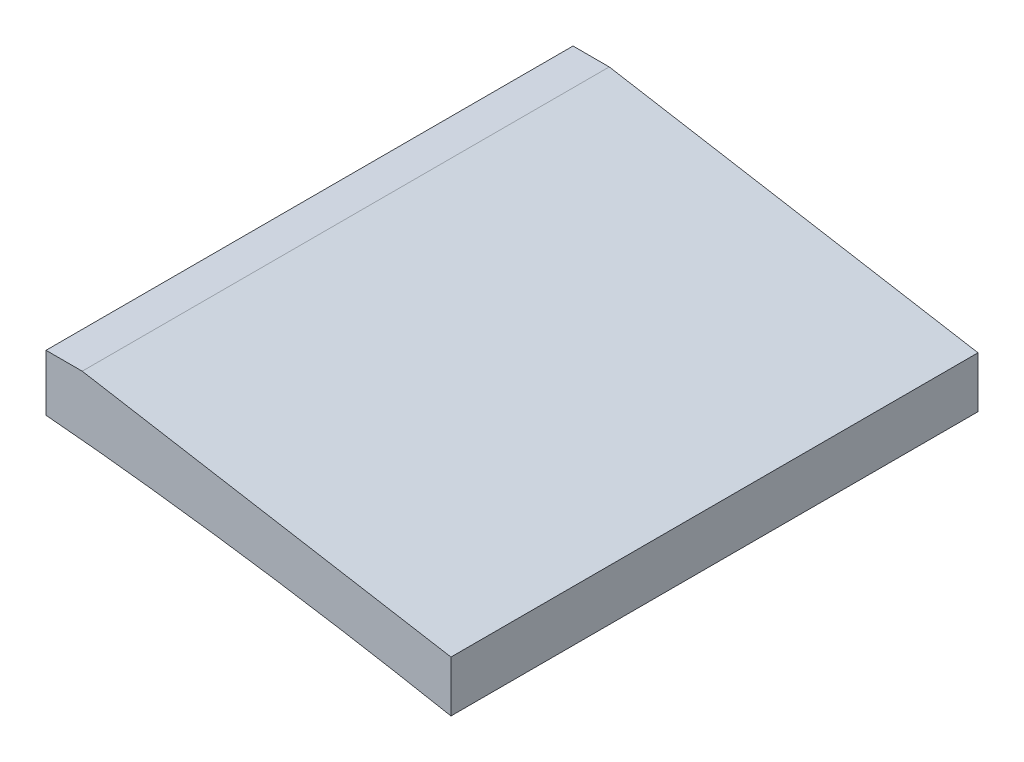
ISO-10303-21;
HEADER;
FILE_DESCRIPTION(('STEP AP214'),'2;1');
FILE_NAME('part.step','',(''),(''),'','','');
FILE_SCHEMA(('AUTOMOTIVE_DESIGN { 1 0 10303 214 1 1 1 1 }'));
ENDSEC;
DATA;
#1=APPLICATION_CONTEXT('core data for automotive mechanical design processes');
#2=APPLICATION_PROTOCOL_DEFINITION('international standard','automotive_design',2000,#1);
#3=PRODUCT_CONTEXT('',#1,'mechanical');
#4=PRODUCT('Part','Part','',(#3));
#5=PRODUCT_RELATED_PRODUCT_CATEGORY('part','',(#4));
#6=PRODUCT_DEFINITION_FORMATION('','',#4);
#7=PRODUCT_DEFINITION_CONTEXT('part definition',#1,'design');
#8=PRODUCT_DEFINITION('design','',#6,#7);
#9=PRODUCT_DEFINITION_SHAPE('','',#8);
#10=(LENGTH_UNIT() NAMED_UNIT(*) SI_UNIT(.MILLI.,.METRE.));
#11=(NAMED_UNIT(*) PLANE_ANGLE_UNIT() SI_UNIT($,.RADIAN.));
#12=(NAMED_UNIT(*) SI_UNIT($,.STERADIAN.) SOLID_ANGLE_UNIT());
#13=UNCERTAINTY_MEASURE_WITH_UNIT(LENGTH_MEASURE(1.E-05),#10,'distance_accuracy_value','');
#14=(GEOMETRIC_REPRESENTATION_CONTEXT(3) GLOBAL_UNCERTAINTY_ASSIGNED_CONTEXT((#13)) GLOBAL_UNIT_ASSIGNED_CONTEXT((#10,
#11,#12)) REPRESENTATION_CONTEXT('',''));
#15=CARTESIAN_POINT('',(0.,0.,0.));
#16=DIRECTION('',(0.,0.,1.));
#17=DIRECTION('',(1.,0.,0.));
#18=AXIS2_PLACEMENT_3D('',#15,#16,#17);
#19=CARTESIAN_POINT('',(122.012987748225,0.,0.));
#20=DIRECTION('',(1.,0.,0.));
#21=DIRECTION('',(0.,0.,-1.));
#22=AXIS2_PLACEMENT_3D('',#19,#20,#21);
#23=PLANE('',#22);
#24=DIRECTION('',(0.,0.,-1.));
#25=VECTOR('',#24,1.);
#26=CARTESIAN_POINT('',(122.012987748225,37.5747443686515,-577.230552036248));
#27=LINE('',#26,#25);
#28=CARTESIAN_POINT('',(122.012987748225,37.5747443686515,-205.139999999972));
#29=VERTEX_POINT('',#28);
#30=CARTESIAN_POINT('',(122.012987748225,37.5747443686515,-335.28));
#31=VERTEX_POINT('',#30);
#32=EDGE_CURVE('E97',#29,#31,#27,.T.);
#33=ORIENTED_EDGE('',*,*,#32,.T.);
#34=DIRECTION('',(0.,-1.,0.));
#35=VECTOR('',#34,1.);
#36=CARTESIAN_POINT('',(122.012987748225,0.,-335.28));
#37=LINE('',#36,#35);
#38=CARTESIAN_POINT('',(122.012987748225,23.6750316889987,-335.28));
#39=VERTEX_POINT('',#38);
#40=EDGE_CURVE('E99',#31,#39,#37,.T.);
#41=ORIENTED_EDGE('',*,*,#40,.T.);
#42=DIRECTION('',(0.,0.,1.));
#43=VECTOR('',#42,1.);
#44=CARTESIAN_POINT('',(122.012987748225,23.6750316889987,-205.14));
#45=LINE('',#44,#43);
#46=CARTESIAN_POINT('',(122.012987748225,23.6750316889987,-205.139999999972));
#47=VERTEX_POINT('',#46);
#48=EDGE_CURVE('E46',#39,#47,#45,.T.);
#49=ORIENTED_EDGE('',*,*,#48,.T.);
#50=DIRECTION('',(0.,-1.,0.));
#51=VECTOR('',#50,1.);
#52=CARTESIAN_POINT('',(122.012987748225,0.,-205.14));
#53=LINE('',#52,#51);
#54=EDGE_CURVE('E11',#29,#47,#53,.T.);
#55=ORIENTED_EDGE('',*,*,#54,.F.);
#56=EDGE_LOOP('',(#33,#41,#49,#55));
#57=FACE_BOUND('',#56,.T.);
#58=ADVANCED_FACE('F42',(#57),#23,.F.);
#59=CARTESIAN_POINT('',(0.,0.,-205.14));
#60=DIRECTION('',(0.,0.,1.));
#61=DIRECTION('',(1.,0.,0.));
#62=AXIS2_PLACEMENT_3D('',#59,#60,#61);
#63=PLANE('',#62);
#64=DIRECTION('',(1.,0.,0.));
#65=VECTOR('',#64,1.);
#66=CARTESIAN_POINT('',(80.9567097007691,37.5747443686515,-205.14));
#67=LINE('',#66,#65);
#68=CARTESIAN_POINT('',(130.956709700769,37.5747443686515,-205.14));
#69=VERTEX_POINT('',#68);
#70=EDGE_CURVE('E103',#29,#69,#67,.T.);
#71=ORIENTED_EDGE('',*,*,#70,.F.);
#72=ORIENTED_EDGE('',*,*,#54,.T.);
#73=CARTESIAN_POINT('',(222.012987748224,-11.2872773614074,-205.14));
#74=CARTESIAN_POINT('',(218.919378665289,-11.3223973767478,-205.14));
#75=CARTESIAN_POINT('',(205.647401932604,-11.467959012407,-205.14));
#76=CARTESIAN_POINT('',(182.199512526804,-11.713706477298,-205.14));
#77=CARTESIAN_POINT('',(151.674497926263,-11.9621131380845,-205.14));
#78=CARTESIAN_POINT('',(121.162418160369,-11.7895754768441,-205.14));
#79=CARTESIAN_POINT('',(95.7513309345537,-11.2827016840826,-205.14));
#80=CARTESIAN_POINT('',(75.4345455748465,-10.6804028674471,-205.14));
#81=CARTESIAN_POINT('',(60.2097930463776,-9.94096056040862,-205.14));
#82=CARTESIAN_POINT('',(44.9946268760517,-8.80564765903787,-205.14));
#83=CARTESIAN_POINT('',(32.3529914161165,-7.2837069255278,-205.14));
#84=CARTESIAN_POINT('',(22.2477539606058,-5.63338955843548,-205.14));
#85=CARTESIAN_POINT('',(14.6666085762918,-3.9200239548407,-205.14));
#86=CARTESIAN_POINT('',(8.28802407863243,-1.74749382065163,-205.14));
#87=CARTESIAN_POINT('',(2.90931259967548,0.956364700460667,-205.14));
#88=CARTESIAN_POINT('',(-1.89672620175331,6.52309669841284,-205.14));
#89=CARTESIAN_POINT('',(3.30662672053229,12.3039979945625,-205.14));
#90=CARTESIAN_POINT('',(9.09601436595202,15.5028984571257,-205.14));
#91=CARTESIAN_POINT('',(15.7472415942778,18.0443175722951,-205.14));
#92=CARTESIAN_POINT('',(23.5496671131226,20.117144312983,-205.14));
#93=CARTESIAN_POINT('',(33.8131815469566,22.3100945885303,-205.14));
#94=CARTESIAN_POINT('',(46.6352298566183,24.0543554633795,-205.14));
#95=CARTESIAN_POINT('',(61.9933352536892,25.2148612571156,-205.14));
#96=CARTESIAN_POINT('',(77.2950113671835,25.6577224294329,-205.14));
#97=CARTESIAN_POINT('',(97.6391657162876,25.4475340689814,-205.14));
#98=CARTESIAN_POINT('',(123.024226631959,23.8278748307742,-205.14));
#99=CARTESIAN_POINT('',(153.375544596371,20.4498563865987,-205.14));
#100=CARTESIAN_POINT('',(183.689332827867,16.2123042667402,-205.14));
#101=CARTESIAN_POINT('',(206.541071450016,12.2763423304222,-205.14));
#102=CARTESIAN_POINT('',(219.305332632429,9.88286237214647,-205.14));
#103=CARTESIAN_POINT('',(222.012987748224,9.36643436036431,-205.14));
#104=B_SPLINE_CURVE_WITH_KNOTS('',3,(#73,#74,#75,#76,#77,#78,#79,#80,#81,#82,#83,#84,#85,#86,
#87,#88,#89,#90,#91,#92,#93,#94,#95,#96,#97,#98,#99,#100,#101,#102,#103),.UNSPECIFIED.,.F.,.F.,
(4,1,1,1,1,1,1,1,1,1,1,1,1,1,1,1,1,1,1,1,1,1,1,1,1,1,1,1,4),(0.135902519716628,
0.150834774390607,0.199963506565112,0.249080491590112,0.298166920869625,0.347226598260492,
0.371748790283378,0.39626612837323,0.42079170287225,0.445368985882971,0.457709830972341,
0.470165482504991,0.482949879419857,0.489791740716257,0.49994201682548,0.512136749797248,
0.519521461450315,0.532994464684655,0.545911051204923,0.558602295103549,0.583586074296184,
0.608309666465215,0.632909244550233,0.657448148326611,0.706484295518651,0.755595699663312,
0.804819773504179,0.854194550210178,0.867498350403516),.UNSPECIFIED.);
#105=CARTESIAN_POINT('',(222.012987748225,9.36643436036435,-205.14));
#106=VERTEX_POINT('',#105);
#107=EDGE_CURVE('E94',#106,#47,#104,.F.);
#108=ORIENTED_EDGE('',*,*,#107,.F.);
#109=DIRECTION('',(0.,-1.,0.));
#110=VECTOR('',#109,1.);
#111=CARTESIAN_POINT('',(222.012987748225,9.36643436036435,-205.14));
#112=LINE('',#111,#110);
#113=CARTESIAN_POINT('',(222.012987748225,21.9728172422315,-205.14));
#114=VERTEX_POINT('',#113);
#115=EDGE_CURVE('E132',#114,#106,#112,.T.);
#116=ORIENTED_EDGE('',*,*,#115,.F.);
#117=DIRECTION('',(0.9856361688841,-0.168882629620322,0.));
#118=VECTOR('',#117,1.);
#119=CARTESIAN_POINT('',(130.956709700769,37.5747443686515,-205.14));
#120=LINE('',#119,#118);
#121=EDGE_CURVE('E135',#69,#114,#120,.T.);
#122=ORIENTED_EDGE('',*,*,#121,.F.);
#123=EDGE_LOOP('',(#71,#72,#108,#116,#122));
#124=FACE_BOUND('',#123,.T.);
#125=ADVANCED_FACE('F163',(#124),#63,.T.);
#126=CARTESIAN_POINT('',(80.9567097007691,37.5747443686515,-577.230552036248));
#127=DIRECTION('',(0.,1.,0.));
#128=DIRECTION('',(0.,0.,1.));
#129=AXIS2_PLACEMENT_3D('',#126,#127,#128);
#130=PLANE('',#129);
#131=ORIENTED_EDGE('',*,*,#32,.F.);
#132=ORIENTED_EDGE('',*,*,#70,.T.);
#133=DIRECTION('',(0.,0.,1.));
#134=VECTOR('',#133,1.);
#135=CARTESIAN_POINT('',(130.956709700769,37.5747443686515,-577.230552036248));
#136=LINE('',#135,#134);
#137=CARTESIAN_POINT('',(130.956709700769,37.5747443686515,-335.28));
#138=VERTEX_POINT('',#137);
#139=EDGE_CURVE('E114',#138,#69,#136,.T.);
#140=ORIENTED_EDGE('',*,*,#139,.F.);
#141=DIRECTION('',(-1.,0.,0.));
#142=VECTOR('',#141,1.);
#143=CARTESIAN_POINT('',(80.9567097007691,37.5747443686515,-335.28));
#144=LINE('',#143,#142);
#145=EDGE_CURVE('E109',#138,#31,#144,.T.);
#146=ORIENTED_EDGE('',*,*,#145,.T.);
#147=EDGE_LOOP('',(#131,#132,#140,#146));
#148=FACE_BOUND('',#147,.T.);
#149=ADVANCED_FACE('F160',(#148),#130,.T.);
#150=CARTESIAN_POINT('',(222.012987748224,-11.2872773614074,-577.230552036248));
#151=CARTESIAN_POINT('',(218.919378665289,-11.3223973767478,-577.230552036248));
#152=CARTESIAN_POINT('',(205.647401932604,-11.467959012407,-577.230552036248));
#153=CARTESIAN_POINT('',(182.199512526804,-11.713706477298,-577.230552036248));
#154=CARTESIAN_POINT('',(151.674497926263,-11.9621131380845,-577.230552036248));
#155=CARTESIAN_POINT('',(121.162418160369,-11.7895754768441,-577.230552036248));
#156=CARTESIAN_POINT('',(95.7513309345537,-11.2827016840826,-577.230552036248));
#157=CARTESIAN_POINT('',(75.4345455748465,-10.6804028674471,-577.230552036248));
#158=CARTESIAN_POINT('',(60.2097930463776,-9.94096056040862,-577.230552036248));
#159=CARTESIAN_POINT('',(44.9946268760517,-8.80564765903787,-577.230552036248));
#160=CARTESIAN_POINT('',(32.3529914161165,-7.2837069255278,-577.230552036248));
#161=CARTESIAN_POINT('',(22.2477539606058,-5.63338955843548,-577.230552036248));
#162=CARTESIAN_POINT('',(14.6666085762918,-3.9200239548407,-577.230552036248));
#163=CARTESIAN_POINT('',(8.28802407863243,-1.74749382065163,-577.230552036248));
#164=CARTESIAN_POINT('',(2.90931259967548,0.956364700460667,-577.230552036248));
#165=CARTESIAN_POINT('',(-1.89672620175331,6.52309669841284,-577.230552036248));
#166=CARTESIAN_POINT('',(3.30662672053229,12.3039979945625,-577.230552036248));
#167=CARTESIAN_POINT('',(9.09601436595202,15.5028984571257,-577.230552036248));
#168=CARTESIAN_POINT('',(15.7472415942778,18.0443175722951,-577.230552036248));
#169=CARTESIAN_POINT('',(23.5496671131226,20.117144312983,-577.230552036248));
#170=CARTESIAN_POINT('',(33.8131815469566,22.3100945885303,-577.230552036248));
#171=CARTESIAN_POINT('',(46.6352298566183,24.0543554633795,-577.230552036248));
#172=CARTESIAN_POINT('',(61.9933352536892,25.2148612571156,-577.230552036248));
#173=CARTESIAN_POINT('',(77.2950113671835,25.6577224294329,-577.230552036248));
#174=CARTESIAN_POINT('',(97.6391657162876,25.4475340689814,-577.230552036248));
#175=CARTESIAN_POINT('',(123.024226631959,23.8278748307742,-577.230552036248));
#176=CARTESIAN_POINT('',(153.375544596371,20.4498563865987,-577.230552036248));
#177=CARTESIAN_POINT('',(183.689332827867,16.2123042667402,-577.230552036248));
#178=CARTESIAN_POINT('',(206.541071450016,12.2763423304222,-577.230552036248));
#179=CARTESIAN_POINT('',(219.305332632429,9.88286237214647,-577.230552036248));
#180=CARTESIAN_POINT('',(222.012987748224,9.36643436036431,-577.230552036248));
#181=B_SPLINE_CURVE_WITH_KNOTS('',3,(#150,#151,#152,#153,#154,#155,#156,#157,#158,#159,#160,
#161,#162,#163,#164,#165,#166,#167,#168,#169,#170,#171,#172,#173,#174,#175,#176,#177,#178,#179,
#180),.UNSPECIFIED.,.F.,.F.,(4,1,1,1,1,1,1,1,1,1,1,1,1,1,1,1,1,1,1,1,1,1,1,1,1,1,1,1,4),
(0.135902519716628,0.150834774390607,0.199963506565112,0.249080491590112,0.298166920869625,
0.347226598260492,0.371748790283378,0.39626612837323,0.42079170287225,0.445368985882971,
0.457709830972341,0.470165482504991,0.482949879419857,0.489791740716257,0.49994201682548,
0.512136749797248,0.519521461450315,0.532994464684655,0.545911051204923,0.558602295103549,
0.583586074296184,0.608309666465215,0.632909244550233,0.657448148326611,0.706484295518651,
0.755595699663312,0.804819773504179,0.854194550210178,0.867498350403516),.UNSPECIFIED.);
#182=DIRECTION('',(0.,0.,1.));
#183=VECTOR('',#182,1.);
#184=SURFACE_OF_LINEAR_EXTRUSION('',#181,#183);
#185=DIRECTION('',(0.,0.,1.));
#186=VECTOR('',#185,1.);
#187=CARTESIAN_POINT('',(222.012987748225,9.36643436036435,-577.230552036248));
#188=LINE('',#187,#186);
#189=CARTESIAN_POINT('',(222.012987748225,9.36643436036435,-335.28));
#190=VERTEX_POINT('',#189);
#191=EDGE_CURVE('E52',#190,#106,#188,.T.);
#192=ORIENTED_EDGE('',*,*,#191,.T.);
#193=ORIENTED_EDGE('',*,*,#107,.T.);
#194=ORIENTED_EDGE('',*,*,#48,.F.);
#195=CARTESIAN_POINT('',(222.012987748224,-11.2872773614074,-335.28));
#196=CARTESIAN_POINT('',(218.919378665289,-11.3223973767478,-335.28));
#197=CARTESIAN_POINT('',(205.647401932604,-11.467959012407,-335.28));
#198=CARTESIAN_POINT('',(182.199512526804,-11.713706477298,-335.28));
#199=CARTESIAN_POINT('',(151.674497926263,-11.9621131380845,-335.28));
#200=CARTESIAN_POINT('',(121.162418160369,-11.7895754768441,-335.28));
#201=CARTESIAN_POINT('',(95.7513309345537,-11.2827016840826,-335.28));
#202=CARTESIAN_POINT('',(75.4345455748465,-10.6804028674471,-335.28));
#203=CARTESIAN_POINT('',(60.2097930463776,-9.94096056040862,-335.28));
#204=CARTESIAN_POINT('',(44.9946268760517,-8.80564765903787,-335.28));
#205=CARTESIAN_POINT('',(32.3529914161165,-7.2837069255278,-335.28));
#206=CARTESIAN_POINT('',(22.2477539606058,-5.63338955843548,-335.28));
#207=CARTESIAN_POINT('',(14.6666085762918,-3.9200239548407,-335.28));
#208=CARTESIAN_POINT('',(8.28802407863243,-1.74749382065163,-335.28));
#209=CARTESIAN_POINT('',(2.90931259967548,0.956364700460667,-335.28));
#210=CARTESIAN_POINT('',(-1.89672620175331,6.52309669841284,-335.28));
#211=CARTESIAN_POINT('',(3.30662672053229,12.3039979945625,-335.28));
#212=CARTESIAN_POINT('',(9.09601436595202,15.5028984571257,-335.28));
#213=CARTESIAN_POINT('',(15.7472415942778,18.0443175722951,-335.28));
#214=CARTESIAN_POINT('',(23.5496671131226,20.117144312983,-335.28));
#215=CARTESIAN_POINT('',(33.8131815469566,22.3100945885303,-335.28));
#216=CARTESIAN_POINT('',(46.6352298566183,24.0543554633795,-335.28));
#217=CARTESIAN_POINT('',(61.9933352536892,25.2148612571156,-335.28));
#218=CARTESIAN_POINT('',(77.2950113671835,25.6577224294329,-335.28));
#219=CARTESIAN_POINT('',(97.6391657162876,25.4475340689814,-335.28));
#220=CARTESIAN_POINT('',(123.024226631959,23.8278748307742,-335.28));
#221=CARTESIAN_POINT('',(153.375544596371,20.4498563865987,-335.28));
#222=CARTESIAN_POINT('',(183.689332827867,16.2123042667402,-335.28));
#223=CARTESIAN_POINT('',(206.541071450016,12.2763423304222,-335.28));
#224=CARTESIAN_POINT('',(219.305332632429,9.88286237214647,-335.28));
#225=CARTESIAN_POINT('',(222.012987748224,9.36643436036431,-335.28));
#226=B_SPLINE_CURVE_WITH_KNOTS('',3,(#195,#196,#197,#198,#199,#200,#201,#202,#203,#204,#205,
#206,#207,#208,#209,#210,#211,#212,#213,#214,#215,#216,#217,#218,#219,#220,#221,#222,#223,#224,
#225),.UNSPECIFIED.,.F.,.F.,(4,1,1,1,1,1,1,1,1,1,1,1,1,1,1,1,1,1,1,1,1,1,1,1,1,1,1,1,4),
(0.135902519716628,0.150834774390607,0.199963506565112,0.249080491590112,0.298166920869625,
0.347226598260492,0.371748790283378,0.39626612837323,0.42079170287225,0.445368985882971,
0.457709830972341,0.470165482504991,0.482949879419857,0.489791740716257,0.49994201682548,
0.512136749797248,0.519521461450315,0.532994464684655,0.545911051204923,0.558602295103549,
0.583586074296184,0.608309666465215,0.632909244550233,0.657448148326611,0.706484295518651,
0.755595699663312,0.804819773504179,0.854194550210178,0.867498350403516),.UNSPECIFIED.);
#227=EDGE_CURVE('E60',#39,#190,#226,.T.);
#228=ORIENTED_EDGE('',*,*,#227,.T.);
#229=EDGE_LOOP('',(#192,#193,#194,#228));
#230=FACE_BOUND('',#229,.T.);
#231=ADVANCED_FACE('F92',(#230),#184,.T.);
#232=CARTESIAN_POINT('',(222.012987748225,9.36643436036435,-577.230552036248));
#233=DIRECTION('',(1.,0.,0.));
#234=DIRECTION('',(0.,0.,-1.));
#235=AXIS2_PLACEMENT_3D('',#232,#233,#234);
#236=PLANE('',#235);
#237=DIRECTION('',(0.,0.,1.));
#238=VECTOR('',#237,1.);
#239=CARTESIAN_POINT('',(222.012987748225,21.9728172422315,-577.230552036248));
#240=LINE('',#239,#238);
#241=CARTESIAN_POINT('',(222.012987748225,21.9728172422315,-335.28));
#242=VERTEX_POINT('',#241);
#243=EDGE_CURVE('E140',#242,#114,#240,.T.);
#244=ORIENTED_EDGE('',*,*,#243,.T.);
#245=ORIENTED_EDGE('',*,*,#115,.T.);
#246=ORIENTED_EDGE('',*,*,#191,.F.);
#247=DIRECTION('',(0.,1.,0.));
#248=VECTOR('',#247,1.);
#249=CARTESIAN_POINT('',(222.012987748225,9.36643436036435,-335.28));
#250=LINE('',#249,#248);
#251=EDGE_CURVE('E106',#190,#242,#250,.T.);
#252=ORIENTED_EDGE('',*,*,#251,.T.);
#253=EDGE_LOOP('',(#244,#245,#246,#252));
#254=FACE_BOUND('',#253,.T.);
#255=ADVANCED_FACE('F165',(#254),#236,.T.);
#256=CARTESIAN_POINT('',(130.956709700769,37.5747443686515,-577.230552036248));
#257=DIRECTION('',(0.168882629620322,0.985636168884099,0.));
#258=DIRECTION('',(-0.9856361688841,0.168882629620322,0.));
#259=AXIS2_PLACEMENT_3D('',#256,#257,#258);
#260=PLANE('',#259);
#261=ORIENTED_EDGE('',*,*,#139,.T.);
#262=ORIENTED_EDGE('',*,*,#121,.T.);
#263=ORIENTED_EDGE('',*,*,#243,.F.);
#264=DIRECTION('',(-0.9856361688841,0.168882629620322,0.));
#265=VECTOR('',#264,1.);
#266=CARTESIAN_POINT('',(130.956709700769,37.5747443686515,-335.28));
#267=LINE('',#266,#265);
#268=EDGE_CURVE('E68',#242,#138,#267,.T.);
#269=ORIENTED_EDGE('',*,*,#268,.T.);
#270=EDGE_LOOP('',(#261,#262,#263,#269));
#271=FACE_BOUND('',#270,.T.);
#272=ADVANCED_FACE('F157',(#271),#260,.T.);
#273=CARTESIAN_POINT('',(0.,0.,-335.28));
#274=DIRECTION('',(0.,0.,-1.));
#275=DIRECTION('',(-1.,0.,0.));
#276=AXIS2_PLACEMENT_3D('',#273,#274,#275);
#277=PLANE('',#276);
#278=ORIENTED_EDGE('',*,*,#40,.F.);
#279=ORIENTED_EDGE('',*,*,#145,.F.);
#280=ORIENTED_EDGE('',*,*,#268,.F.);
#281=ORIENTED_EDGE('',*,*,#251,.F.);
#282=ORIENTED_EDGE('',*,*,#227,.F.);
#283=EDGE_LOOP('',(#278,#279,#280,#281,#282));
#284=FACE_BOUND('',#283,.T.);
#285=ADVANCED_FACE('F44',(#284),#277,.T.);
#286=CLOSED_SHELL('',(#58,#125,#149,#231,#255,#272,#285));
#287=MANIFOLD_SOLID_BREP('B2',#286);
#288=ADVANCED_BREP_SHAPE_REPRESENTATION('',(#18,#287),#14);
#289=SHAPE_DEFINITION_REPRESENTATION(#9,#288);
ENDSEC;
END-ISO-10303-21;
